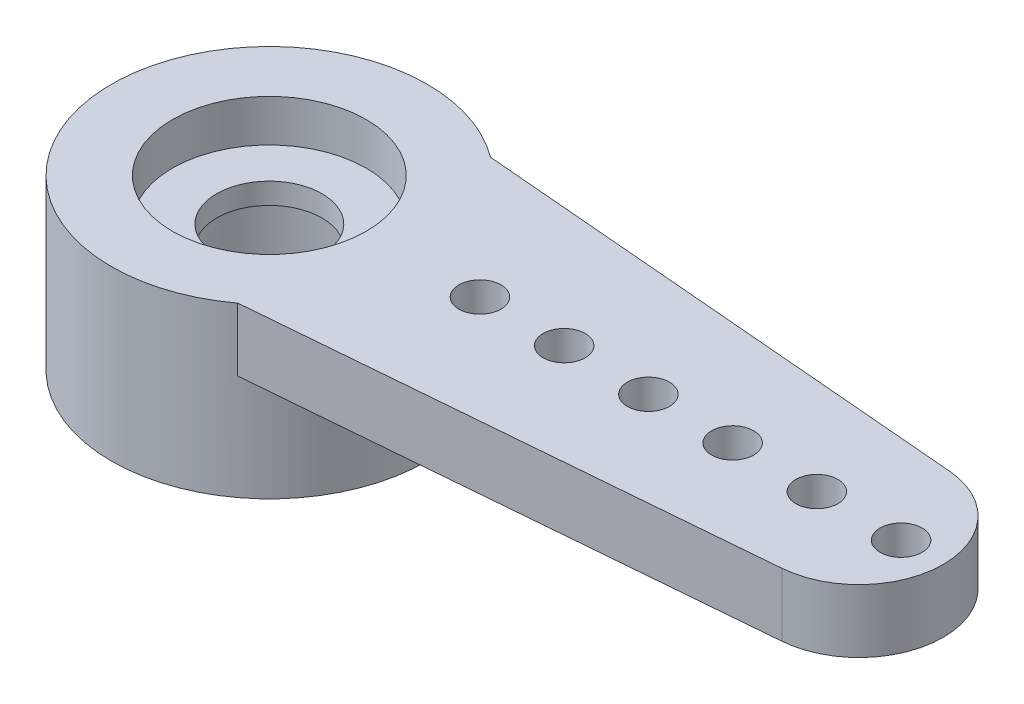
ISO-10303-21;
HEADER;
FILE_DESCRIPTION(('STEP AP214'),'2;1');
FILE_NAME('part.step','',(''),(''),'','','');
FILE_SCHEMA(('AUTOMOTIVE_DESIGN { 1 0 10303 214 1 1 1 1 }'));
ENDSEC;
DATA;
#1=APPLICATION_CONTEXT('core data for automotive mechanical design processes');
#2=APPLICATION_PROTOCOL_DEFINITION('international standard','automotive_design',2000,#1);
#3=PRODUCT_CONTEXT('',#1,'mechanical');
#4=PRODUCT('Part','Part','',(#3));
#5=PRODUCT_RELATED_PRODUCT_CATEGORY('part','',(#4));
#6=PRODUCT_DEFINITION_FORMATION('','',#4);
#7=PRODUCT_DEFINITION_CONTEXT('part definition',#1,'design');
#8=PRODUCT_DEFINITION('design','',#6,#7);
#9=PRODUCT_DEFINITION_SHAPE('','',#8);
#10=(LENGTH_UNIT() NAMED_UNIT(*) SI_UNIT(.MILLI.,.METRE.));
#11=(NAMED_UNIT(*) PLANE_ANGLE_UNIT() SI_UNIT($,.RADIAN.));
#12=(NAMED_UNIT(*) SI_UNIT($,.STERADIAN.) SOLID_ANGLE_UNIT());
#13=UNCERTAINTY_MEASURE_WITH_UNIT(LENGTH_MEASURE(1.E-05),#10,'distance_accuracy_value','');
#14=(GEOMETRIC_REPRESENTATION_CONTEXT(3) GLOBAL_UNCERTAINTY_ASSIGNED_CONTEXT((#13)) GLOBAL_UNIT_ASSIGNED_CONTEXT((#10,
#11,#12)) REPRESENTATION_CONTEXT('',''));
#15=CARTESIAN_POINT('',(0.,0.,0.));
#16=DIRECTION('',(0.,0.,1.));
#17=DIRECTION('',(1.,0.,0.));
#18=AXIS2_PLACEMENT_3D('',#15,#16,#17);
#19=CARTESIAN_POINT('',(0.,-1.5,0.));
#20=DIRECTION('',(0.,1.,0.));
#21=DIRECTION('',(0.,0.,1.));
#22=AXIS2_PLACEMENT_3D('',#19,#20,#21);
#23=CYLINDRICAL_SURFACE('',#22,1.25);
#24=CARTESIAN_POINT('',(0.,3.,0.));
#25=DIRECTION('',(0.,1.,0.));
#26=DIRECTION('',(0.,0.,1.));
#27=AXIS2_PLACEMENT_3D('',#24,#25,#26);
#28=CIRCLE('',#27,1.25);
#29=CARTESIAN_POINT('',(0.,3.,1.25));
#30=VERTEX_POINT('',#29);
#31=EDGE_CURVE('E190',#30,#30,#28,.T.);
#32=ORIENTED_EDGE('',*,*,#31,.T.);
#33=EDGE_LOOP('',(#32));
#34=FACE_BOUND('',#33,.T.);
#35=CARTESIAN_POINT('',(0.,2.5,0.));
#36=DIRECTION('',(0.,-1.,0.));
#37=DIRECTION('',(0.,0.,-1.));
#38=AXIS2_PLACEMENT_3D('',#35,#36,#37);
#39=CIRCLE('',#38,1.25);
#40=CARTESIAN_POINT('',(0.,2.5,-1.25));
#41=VERTEX_POINT('',#40);
#42=EDGE_CURVE('E38',#41,#41,#39,.F.);
#43=ORIENTED_EDGE('',*,*,#42,.F.);
#44=EDGE_LOOP('',(#43));
#45=FACE_BOUND('',#44,.T.);
#46=ADVANCED_FACE('F34',(#34,#45),#23,.F.);
#47=CARTESIAN_POINT('',(0.,4.,0.));
#48=DIRECTION('',(0.,-1.,0.));
#49=DIRECTION('',(0.,0.,-1.));
#50=AXIS2_PLACEMENT_3D('',#47,#48,#49);
#51=CYLINDRICAL_SURFACE('',#50,3.75);
#52=CARTESIAN_POINT('',(0.,4.,0.));
#53=DIRECTION('',(0.,1.,0.));
#54=DIRECTION('',(0.,0.,1.));
#55=AXIS2_PLACEMENT_3D('',#52,#53,#54);
#56=CIRCLE('',#55,3.75);
#57=CARTESIAN_POINT('',(2.25,4.,-3.));
#58=VERTEX_POINT('',#57);
#59=CARTESIAN_POINT('',(2.25,4.,3.));
#60=VERTEX_POINT('',#59);
#61=EDGE_CURVE('E11',#58,#60,#56,.T.);
#62=ORIENTED_EDGE('',*,*,#61,.F.);
#63=DIRECTION('',(0.,1.,0.));
#64=VECTOR('',#63,1.);
#65=CARTESIAN_POINT('',(2.25,2.5,-3.));
#66=LINE('',#65,#64);
#67=CARTESIAN_POINT('',(2.25,2.5,-3.));
#68=VERTEX_POINT('',#67);
#69=EDGE_CURVE('E107',#68,#58,#66,.T.);
#70=ORIENTED_EDGE('',*,*,#69,.F.);
#71=CARTESIAN_POINT('',(0.,2.5,0.));
#72=DIRECTION('',(0.,-1.,0.));
#73=DIRECTION('',(0.,0.,-1.));
#74=AXIS2_PLACEMENT_3D('',#71,#72,#73);
#75=CIRCLE('',#74,3.75);
#76=CARTESIAN_POINT('',(2.25,2.5,3.));
#77=VERTEX_POINT('',#76);
#78=EDGE_CURVE('E59',#68,#77,#75,.T.);
#79=ORIENTED_EDGE('',*,*,#78,.T.);
#80=DIRECTION('',(0.,1.,0.));
#81=VECTOR('',#80,1.);
#82=CARTESIAN_POINT('',(2.25,2.5,3.));
#83=LINE('',#82,#81);
#84=EDGE_CURVE('E83',#77,#60,#83,.T.);
#85=ORIENTED_EDGE('',*,*,#84,.T.);
#86=EDGE_LOOP('',(#62,#70,#79,#85));
#87=FACE_BOUND('',#86,.T.);
#88=CARTESIAN_POINT('',(0.,0.,0.));
#89=DIRECTION('',(0.,1.,0.));
#90=DIRECTION('',(0.,0.,1.));
#91=AXIS2_PLACEMENT_3D('',#88,#89,#90);
#92=CIRCLE('',#91,3.75);
#93=CARTESIAN_POINT('',(0.,0.,3.75));
#94=VERTEX_POINT('',#93);
#95=EDGE_CURVE('E43',#94,#94,#92,.T.);
#96=ORIENTED_EDGE('',*,*,#95,.T.);
#97=EDGE_LOOP('',(#96));
#98=FACE_BOUND('',#97,.T.);
#99=ADVANCED_FACE('F36',(#87,#98),#51,.T.);
#100=CARTESIAN_POINT('',(0.,4.,0.));
#101=DIRECTION('',(0.,1.,0.));
#102=DIRECTION('',(0.,0.,1.));
#103=AXIS2_PLACEMENT_3D('',#100,#101,#102);
#104=PLANE('',#103);
#105=CARTESIAN_POINT('',(0.,4.,0.));
#106=DIRECTION('',(0.,1.,0.));
#107=DIRECTION('',(0.,0.,1.));
#108=AXIS2_PLACEMENT_3D('',#105,#106,#107);
#109=CIRCLE('',#108,2.3);
#110=CARTESIAN_POINT('',(0.,4.,2.3));
#111=VERTEX_POINT('',#110);
#112=EDGE_CURVE('E109',#111,#111,#109,.T.);
#113=ORIENTED_EDGE('',*,*,#112,.F.);
#114=EDGE_LOOP('',(#113));
#115=FACE_BOUND('',#114,.T.);
#116=ORIENTED_EDGE('',*,*,#61,.T.);
#117=DIRECTION('',(0.996448898518601,0.,-0.0841997187707063));
#118=VECTOR('',#117,1.);
#119=CARTESIAN_POINT('',(14.1683994375414,4.,1.9928977970372));
#120=LINE('',#119,#118);
#121=CARTESIAN_POINT('',(14.1683994375414,4.,1.99289779703721));
#122=VERTEX_POINT('',#121);
#123=EDGE_CURVE('E102',#60,#122,#120,.T.);
#124=ORIENTED_EDGE('',*,*,#123,.T.);
#125=CARTESIAN_POINT('',(14.,4.,0.));
#126=DIRECTION('',(0.,1.,0.));
#127=DIRECTION('',(0.,0.,-1.));
#128=AXIS2_PLACEMENT_3D('',#125,#126,#127);
#129=CIRCLE('',#128,2.);
#130=CARTESIAN_POINT('',(14.1683994375414,4.,-1.9928977970372));
#131=VERTEX_POINT('',#130);
#132=EDGE_CURVE('E89',#122,#131,#129,.T.);
#133=ORIENTED_EDGE('',*,*,#132,.T.);
#134=DIRECTION('',(-0.996448898518601,0.,-0.0841997187707069));
#135=VECTOR('',#134,1.);
#136=CARTESIAN_POINT('',(14.1683994375414,4.,-1.9928977970372));
#137=LINE('',#136,#135);
#138=EDGE_CURVE('E50',#131,#58,#137,.T.);
#139=ORIENTED_EDGE('',*,*,#138,.T.);
#140=EDGE_LOOP('',(#116,#124,#133,#139));
#141=FACE_BOUND('',#140,.T.);
#142=CARTESIAN_POINT('',(13.,4.,0.));
#143=DIRECTION('',(0.,1.,0.));
#144=DIRECTION('',(0.,0.,-1.));
#145=AXIS2_PLACEMENT_3D('',#142,#143,#144);
#146=CIRCLE('',#145,0.500000000000001);
#147=CARTESIAN_POINT('',(13.,4.,-0.499999999999997));
#148=VERTEX_POINT('',#147);
#149=EDGE_CURVE('E199',#148,#148,#146,.T.);
#150=ORIENTED_EDGE('',*,*,#149,.F.);
#151=EDGE_LOOP('',(#150));
#152=FACE_BOUND('',#151,.T.);
#153=CARTESIAN_POINT('',(11.,4.,0.));
#154=DIRECTION('',(0.,1.,0.));
#155=DIRECTION('',(0.,0.,-1.));
#156=AXIS2_PLACEMENT_3D('',#153,#154,#155);
#157=CIRCLE('',#156,0.500000000000001);
#158=CARTESIAN_POINT('',(11.,4.,-0.499999999999997));
#159=VERTEX_POINT('',#158);
#160=EDGE_CURVE('E203',#159,#159,#157,.T.);
#161=ORIENTED_EDGE('',*,*,#160,.F.);
#162=EDGE_LOOP('',(#161));
#163=FACE_BOUND('',#162,.T.);
#164=CARTESIAN_POINT('',(9.,4.,0.));
#165=DIRECTION('',(0.,1.,0.));
#166=DIRECTION('',(0.,0.,-1.));
#167=AXIS2_PLACEMENT_3D('',#164,#165,#166);
#168=CIRCLE('',#167,0.500000000000001);
#169=CARTESIAN_POINT('',(9.,4.,-0.499999999999997));
#170=VERTEX_POINT('',#169);
#171=EDGE_CURVE('E207',#170,#170,#168,.T.);
#172=ORIENTED_EDGE('',*,*,#171,.F.);
#173=EDGE_LOOP('',(#172));
#174=FACE_BOUND('',#173,.T.);
#175=CARTESIAN_POINT('',(7.,4.,0.));
#176=DIRECTION('',(0.,1.,0.));
#177=DIRECTION('',(0.,0.,-1.));
#178=AXIS2_PLACEMENT_3D('',#175,#176,#177);
#179=CIRCLE('',#178,0.500000000000001);
#180=CARTESIAN_POINT('',(7.,4.,-0.499999999999997));
#181=VERTEX_POINT('',#180);
#182=EDGE_CURVE('E211',#181,#181,#179,.T.);
#183=ORIENTED_EDGE('',*,*,#182,.F.);
#184=EDGE_LOOP('',(#183));
#185=FACE_BOUND('',#184,.T.);
#186=CARTESIAN_POINT('',(5.,4.,0.));
#187=DIRECTION('',(0.,1.,0.));
#188=DIRECTION('',(0.,0.,-1.));
#189=AXIS2_PLACEMENT_3D('',#186,#187,#188);
#190=CIRCLE('',#189,0.500000000000001);
#191=CARTESIAN_POINT('',(5.,4.,-0.499999999999997));
#192=VERTEX_POINT('',#191);
#193=EDGE_CURVE('E215',#192,#192,#190,.T.);
#194=ORIENTED_EDGE('',*,*,#193,.F.);
#195=EDGE_LOOP('',(#194));
#196=FACE_BOUND('',#195,.T.);
#197=CARTESIAN_POINT('',(15.,4.,0.));
#198=DIRECTION('',(0.,1.,0.));
#199=DIRECTION('',(0.,0.,-1.));
#200=AXIS2_PLACEMENT_3D('',#197,#198,#199);
#201=CIRCLE('',#200,0.500000000000001);
#202=CARTESIAN_POINT('',(15.,4.,-0.499999999999997));
#203=VERTEX_POINT('',#202);
#204=EDGE_CURVE('E218',#203,#203,#201,.T.);
#205=ORIENTED_EDGE('',*,*,#204,.F.);
#206=EDGE_LOOP('',(#205));
#207=FACE_BOUND('',#206,.T.);
#208=ADVANCED_FACE('F123',(#115,#141,#152,#163,#174,#185,#196,#207),#104,.T.);
#209=CARTESIAN_POINT('',(0.,0.,0.));
#210=DIRECTION('',(0.,1.,0.));
#211=DIRECTION('',(0.,0.,1.));
#212=AXIS2_PLACEMENT_3D('',#209,#210,#211);
#213=PLANE('',#212);
#214=CARTESIAN_POINT('',(0.,0.,0.));
#215=DIRECTION('',(0.,-1.,0.));
#216=DIRECTION('',(0.,0.,-1.));
#217=AXIS2_PLACEMENT_3D('',#214,#215,#216);
#218=CIRCLE('',#217,2.3);
#219=CARTESIAN_POINT('',(0.,0.,-2.3));
#220=VERTEX_POINT('',#219);
#221=EDGE_CURVE('E244',#220,#220,#218,.T.);
#222=ORIENTED_EDGE('',*,*,#221,.F.);
#223=EDGE_LOOP('',(#222));
#224=FACE_BOUND('',#223,.T.);
#225=ORIENTED_EDGE('',*,*,#95,.F.);
#226=EDGE_LOOP('',(#225));
#227=FACE_BOUND('',#226,.T.);
#228=ADVANCED_FACE('F120',(#224,#227),#213,.F.);
#229=CARTESIAN_POINT('',(0.,3.,0.));
#230=DIRECTION('',(0.,1.,0.));
#231=DIRECTION('',(0.,0.,1.));
#232=AXIS2_PLACEMENT_3D('',#229,#230,#231);
#233=CYLINDRICAL_SURFACE('',#232,2.3);
#234=CARTESIAN_POINT('',(0.,3.,0.));
#235=DIRECTION('',(0.,1.,0.));
#236=DIRECTION('',(0.,0.,1.));
#237=AXIS2_PLACEMENT_3D('',#234,#235,#236);
#238=CIRCLE('',#237,2.3);
#239=CARTESIAN_POINT('',(0.,3.,2.3));
#240=VERTEX_POINT('',#239);
#241=EDGE_CURVE('E112',#240,#240,#238,.T.);
#242=ORIENTED_EDGE('',*,*,#241,.F.);
#243=EDGE_LOOP('',(#242));
#244=FACE_BOUND('',#243,.T.);
#245=ORIENTED_EDGE('',*,*,#112,.T.);
#246=EDGE_LOOP('',(#245));
#247=FACE_BOUND('',#246,.T.);
#248=ADVANCED_FACE('F122',(#244,#247),#233,.F.);
#249=CARTESIAN_POINT('',(0.,3.,0.));
#250=DIRECTION('',(0.,1.,0.));
#251=DIRECTION('',(0.,0.,1.));
#252=AXIS2_PLACEMENT_3D('',#249,#250,#251);
#253=PLANE('',#252);
#254=ORIENTED_EDGE('',*,*,#31,.F.);
#255=EDGE_LOOP('',(#254));
#256=FACE_BOUND('',#255,.T.);
#257=ORIENTED_EDGE('',*,*,#241,.T.);
#258=EDGE_LOOP('',(#257));
#259=FACE_BOUND('',#258,.T.);
#260=ADVANCED_FACE('F129',(#256,#259),#253,.T.);
#261=CARTESIAN_POINT('',(14.1683994375414,2.5,-1.9928977970372));
#262=DIRECTION('',(0.0841997187707069,0.,-0.996448898518601));
#263=DIRECTION('',(-0.996448898518601,0.,-0.0841997187707069));
#264=AXIS2_PLACEMENT_3D('',#261,#262,#263);
#265=PLANE('',#264);
#266=ORIENTED_EDGE('',*,*,#138,.F.);
#267=DIRECTION('',(0.,1.,0.));
#268=VECTOR('',#267,1.);
#269=CARTESIAN_POINT('',(14.1683994375414,2.5,-1.9928977970372));
#270=LINE('',#269,#268);
#271=CARTESIAN_POINT('',(14.1683994375414,2.5,-1.9928977970372));
#272=VERTEX_POINT('',#271);
#273=EDGE_CURVE('E77',#272,#131,#270,.T.);
#274=ORIENTED_EDGE('',*,*,#273,.F.);
#275=DIRECTION('',(-0.996448898518601,0.,-0.0841997187707069));
#276=VECTOR('',#275,1.);
#277=CARTESIAN_POINT('',(14.1683994375414,2.5,-1.9928977970372));
#278=LINE('',#277,#276);
#279=EDGE_CURVE('E94',#272,#68,#278,.T.);
#280=ORIENTED_EDGE('',*,*,#279,.T.);
#281=ORIENTED_EDGE('',*,*,#69,.T.);
#282=EDGE_LOOP('',(#266,#274,#280,#281));
#283=FACE_BOUND('',#282,.T.);
#284=ADVANCED_FACE('F176',(#283),#265,.T.);
#285=CARTESIAN_POINT('',(14.,2.5,0.));
#286=DIRECTION('',(0.,1.,0.));
#287=DIRECTION('',(0.,0.,1.));
#288=AXIS2_PLACEMENT_3D('',#285,#286,#287);
#289=CYLINDRICAL_SURFACE('',#288,2.);
#290=ORIENTED_EDGE('',*,*,#132,.F.);
#291=DIRECTION('',(0.,1.,0.));
#292=VECTOR('',#291,1.);
#293=CARTESIAN_POINT('',(14.1683994375414,2.5,1.99289779703721));
#294=LINE('',#293,#292);
#295=CARTESIAN_POINT('',(14.1683994375414,2.5,1.99289779703721));
#296=VERTEX_POINT('',#295);
#297=EDGE_CURVE('E85',#296,#122,#294,.T.);
#298=ORIENTED_EDGE('',*,*,#297,.F.);
#299=CARTESIAN_POINT('',(14.,2.5,0.));
#300=DIRECTION('',(0.,1.,0.));
#301=DIRECTION('',(0.,0.,-1.));
#302=AXIS2_PLACEMENT_3D('',#299,#300,#301);
#303=CIRCLE('',#302,2.);
#304=EDGE_CURVE('E88',#296,#272,#303,.T.);
#305=ORIENTED_EDGE('',*,*,#304,.T.);
#306=ORIENTED_EDGE('',*,*,#273,.T.);
#307=EDGE_LOOP('',(#290,#298,#305,#306));
#308=FACE_BOUND('',#307,.T.);
#309=ADVANCED_FACE('F87',(#308),#289,.T.);
#310=CARTESIAN_POINT('',(14.1683994375414,2.5,1.9928977970372));
#311=DIRECTION('',(0.0841997187707063,0.,0.996448898518601));
#312=DIRECTION('',(0.996448898518601,0.,-0.0841997187707063));
#313=AXIS2_PLACEMENT_3D('',#310,#311,#312);
#314=PLANE('',#313);
#315=ORIENTED_EDGE('',*,*,#123,.F.);
#316=ORIENTED_EDGE('',*,*,#84,.F.);
#317=DIRECTION('',(0.996448898518601,0.,-0.0841997187707063));
#318=VECTOR('',#317,1.);
#319=CARTESIAN_POINT('',(14.1683994375414,2.5,1.9928977970372));
#320=LINE('',#319,#318);
#321=EDGE_CURVE('E93',#77,#296,#320,.T.);
#322=ORIENTED_EDGE('',*,*,#321,.T.);
#323=ORIENTED_EDGE('',*,*,#297,.T.);
#324=EDGE_LOOP('',(#315,#316,#322,#323));
#325=FACE_BOUND('',#324,.T.);
#326=ADVANCED_FACE('F96',(#325),#314,.T.);
#327=CARTESIAN_POINT('',(0.,2.5,0.));
#328=DIRECTION('',(0.,-1.,0.));
#329=DIRECTION('',(0.,0.,-1.));
#330=AXIS2_PLACEMENT_3D('',#327,#328,#329);
#331=PLANE('',#330);
#332=CARTESIAN_POINT('',(13.,2.5,0.));
#333=DIRECTION('',(0.,1.,0.));
#334=DIRECTION('',(0.,0.,-1.));
#335=AXIS2_PLACEMENT_3D('',#332,#333,#334);
#336=CIRCLE('',#335,0.500000000000001);
#337=CARTESIAN_POINT('',(13.,2.5,-0.499999999999997));
#338=VERTEX_POINT('',#337);
#339=EDGE_CURVE('E237',#338,#338,#336,.T.);
#340=ORIENTED_EDGE('',*,*,#339,.T.);
#341=EDGE_LOOP('',(#340));
#342=FACE_BOUND('',#341,.T.);
#343=CARTESIAN_POINT('',(11.,2.5,0.));
#344=DIRECTION('',(0.,1.,0.));
#345=DIRECTION('',(0.,0.,-1.));
#346=AXIS2_PLACEMENT_3D('',#343,#344,#345);
#347=CIRCLE('',#346,0.500000000000001);
#348=CARTESIAN_POINT('',(11.,2.5,-0.499999999999997));
#349=VERTEX_POINT('',#348);
#350=EDGE_CURVE('E233',#349,#349,#347,.T.);
#351=ORIENTED_EDGE('',*,*,#350,.T.);
#352=EDGE_LOOP('',(#351));
#353=FACE_BOUND('',#352,.T.);
#354=CARTESIAN_POINT('',(9.,2.5,0.));
#355=DIRECTION('',(0.,1.,0.));
#356=DIRECTION('',(0.,0.,-1.));
#357=AXIS2_PLACEMENT_3D('',#354,#355,#356);
#358=CIRCLE('',#357,0.500000000000001);
#359=CARTESIAN_POINT('',(9.,2.5,-0.499999999999997));
#360=VERTEX_POINT('',#359);
#361=EDGE_CURVE('E229',#360,#360,#358,.T.);
#362=ORIENTED_EDGE('',*,*,#361,.T.);
#363=EDGE_LOOP('',(#362));
#364=FACE_BOUND('',#363,.T.);
#365=CARTESIAN_POINT('',(7.,2.5,0.));
#366=DIRECTION('',(0.,1.,0.));
#367=DIRECTION('',(0.,0.,-1.));
#368=AXIS2_PLACEMENT_3D('',#365,#366,#367);
#369=CIRCLE('',#368,0.500000000000001);
#370=CARTESIAN_POINT('',(7.,2.5,-0.499999999999997));
#371=VERTEX_POINT('',#370);
#372=EDGE_CURVE('E226',#371,#371,#369,.T.);
#373=ORIENTED_EDGE('',*,*,#372,.T.);
#374=EDGE_LOOP('',(#373));
#375=FACE_BOUND('',#374,.T.);
#376=CARTESIAN_POINT('',(5.,2.5,0.));
#377=DIRECTION('',(0.,1.,0.));
#378=DIRECTION('',(0.,0.,-1.));
#379=AXIS2_PLACEMENT_3D('',#376,#377,#378);
#380=CIRCLE('',#379,0.500000000000001);
#381=CARTESIAN_POINT('',(5.,2.5,-0.499999999999997));
#382=VERTEX_POINT('',#381);
#383=EDGE_CURVE('E220',#382,#382,#380,.T.);
#384=ORIENTED_EDGE('',*,*,#383,.T.);
#385=EDGE_LOOP('',(#384));
#386=FACE_BOUND('',#385,.T.);
#387=CARTESIAN_POINT('',(15.,2.5,0.));
#388=DIRECTION('',(0.,1.,0.));
#389=DIRECTION('',(0.,0.,-1.));
#390=AXIS2_PLACEMENT_3D('',#387,#388,#389);
#391=CIRCLE('',#390,0.500000000000001);
#392=CARTESIAN_POINT('',(15.,2.5,-0.499999999999997));
#393=VERTEX_POINT('',#392);
#394=EDGE_CURVE('E104',#393,#393,#391,.T.);
#395=ORIENTED_EDGE('',*,*,#394,.T.);
#396=EDGE_LOOP('',(#395));
#397=FACE_BOUND('',#396,.T.);
#398=ORIENTED_EDGE('',*,*,#78,.F.);
#399=ORIENTED_EDGE('',*,*,#279,.F.);
#400=ORIENTED_EDGE('',*,*,#304,.F.);
#401=ORIENTED_EDGE('',*,*,#321,.F.);
#402=EDGE_LOOP('',(#398,#399,#400,#401));
#403=FACE_BOUND('',#402,.T.);
#404=ADVANCED_FACE('F92',(#342,#353,#364,#375,#386,#397,#403),#331,.T.);
#405=CARTESIAN_POINT('',(15.,2.5,0.));
#406=DIRECTION('',(0.,1.,0.));
#407=DIRECTION('',(0.,0.,1.));
#408=AXIS2_PLACEMENT_3D('',#405,#406,#407);
#409=CYLINDRICAL_SURFACE('',#408,0.500000000000001);
#410=ORIENTED_EDGE('',*,*,#394,.F.);
#411=EDGE_LOOP('',(#410));
#412=FACE_BOUND('',#411,.T.);
#413=ORIENTED_EDGE('',*,*,#204,.T.);
#414=EDGE_LOOP('',(#413));
#415=FACE_BOUND('',#414,.T.);
#416=ADVANCED_FACE('F168',(#412,#415),#409,.F.);
#417=CARTESIAN_POINT('',(5.,2.5,0.));
#418=DIRECTION('',(0.,1.,0.));
#419=DIRECTION('',(0.,0.,1.));
#420=AXIS2_PLACEMENT_3D('',#417,#418,#419);
#421=CYLINDRICAL_SURFACE('',#420,0.500000000000001);
#422=ORIENTED_EDGE('',*,*,#383,.F.);
#423=EDGE_LOOP('',(#422));
#424=FACE_BOUND('',#423,.T.);
#425=ORIENTED_EDGE('',*,*,#193,.T.);
#426=EDGE_LOOP('',(#425));
#427=FACE_BOUND('',#426,.T.);
#428=ADVANCED_FACE('F164',(#424,#427),#421,.F.);
#429=CARTESIAN_POINT('',(7.,2.5,0.));
#430=DIRECTION('',(0.,1.,0.));
#431=DIRECTION('',(0.,0.,1.));
#432=AXIS2_PLACEMENT_3D('',#429,#430,#431);
#433=CYLINDRICAL_SURFACE('',#432,0.500000000000001);
#434=ORIENTED_EDGE('',*,*,#372,.F.);
#435=EDGE_LOOP('',(#434));
#436=FACE_BOUND('',#435,.T.);
#437=ORIENTED_EDGE('',*,*,#182,.T.);
#438=EDGE_LOOP('',(#437));
#439=FACE_BOUND('',#438,.T.);
#440=ADVANCED_FACE('F160',(#436,#439),#433,.F.);
#441=CARTESIAN_POINT('',(9.,2.5,0.));
#442=DIRECTION('',(0.,1.,0.));
#443=DIRECTION('',(0.,0.,1.));
#444=AXIS2_PLACEMENT_3D('',#441,#442,#443);
#445=CYLINDRICAL_SURFACE('',#444,0.500000000000001);
#446=ORIENTED_EDGE('',*,*,#361,.F.);
#447=EDGE_LOOP('',(#446));
#448=FACE_BOUND('',#447,.T.);
#449=ORIENTED_EDGE('',*,*,#171,.T.);
#450=EDGE_LOOP('',(#449));
#451=FACE_BOUND('',#450,.T.);
#452=ADVANCED_FACE('F156',(#448,#451),#445,.F.);
#453=CARTESIAN_POINT('',(11.,2.5,0.));
#454=DIRECTION('',(0.,1.,0.));
#455=DIRECTION('',(0.,0.,1.));
#456=AXIS2_PLACEMENT_3D('',#453,#454,#455);
#457=CYLINDRICAL_SURFACE('',#456,0.500000000000001);
#458=ORIENTED_EDGE('',*,*,#350,.F.);
#459=EDGE_LOOP('',(#458));
#460=FACE_BOUND('',#459,.T.);
#461=ORIENTED_EDGE('',*,*,#160,.T.);
#462=EDGE_LOOP('',(#461));
#463=FACE_BOUND('',#462,.T.);
#464=ADVANCED_FACE('F152',(#460,#463),#457,.F.);
#465=CARTESIAN_POINT('',(13.,2.5,0.));
#466=DIRECTION('',(0.,1.,0.));
#467=DIRECTION('',(0.,0.,1.));
#468=AXIS2_PLACEMENT_3D('',#465,#466,#467);
#469=CYLINDRICAL_SURFACE('',#468,0.500000000000001);
#470=ORIENTED_EDGE('',*,*,#339,.F.);
#471=EDGE_LOOP('',(#470));
#472=FACE_BOUND('',#471,.T.);
#473=ORIENTED_EDGE('',*,*,#149,.T.);
#474=EDGE_LOOP('',(#473));
#475=FACE_BOUND('',#474,.T.);
#476=ADVANCED_FACE('F148',(#472,#475),#469,.F.);
#477=CARTESIAN_POINT('',(0.,2.5,0.));
#478=DIRECTION('',(0.,-1.,0.));
#479=DIRECTION('',(0.,0.,-1.));
#480=AXIS2_PLACEMENT_3D('',#477,#478,#479);
#481=PLANE('',#480);
#482=CARTESIAN_POINT('',(0.,2.5,0.));
#483=DIRECTION('',(0.,-1.,0.));
#484=DIRECTION('',(0.,0.,-1.));
#485=AXIS2_PLACEMENT_3D('',#482,#483,#484);
#486=CIRCLE('',#485,2.3);
#487=CARTESIAN_POINT('',(0.,2.5,-2.3));
#488=VERTEX_POINT('',#487);
#489=EDGE_CURVE('E247',#488,#488,#486,.T.);
#490=ORIENTED_EDGE('',*,*,#489,.T.);
#491=EDGE_LOOP('',(#490));
#492=FACE_BOUND('',#491,.T.);
#493=ORIENTED_EDGE('',*,*,#42,.T.);
#494=EDGE_LOOP('',(#493));
#495=FACE_BOUND('',#494,.T.);
#496=ADVANCED_FACE('F151',(#492,#495),#481,.T.);
#497=CARTESIAN_POINT('',(0.,2.5,0.));
#498=DIRECTION('',(0.,-1.,0.));
#499=DIRECTION('',(0.,0.,-1.));
#500=AXIS2_PLACEMENT_3D('',#497,#498,#499);
#501=CYLINDRICAL_SURFACE('',#500,2.3);
#502=ORIENTED_EDGE('',*,*,#489,.F.);
#503=EDGE_LOOP('',(#502));
#504=FACE_BOUND('',#503,.T.);
#505=ORIENTED_EDGE('',*,*,#221,.T.);
#506=EDGE_LOOP('',(#505));
#507=FACE_BOUND('',#506,.T.);
#508=ADVANCED_FACE('F146',(#504,#507),#501,.F.);
#509=CLOSED_SHELL('',(#46,#99,#208,#228,#248,#260,#284,#309,#326,#404,#416,#428,#440,#452,#464,
#476,#496,#508));
#510=MANIFOLD_SOLID_BREP('B2',#509);
#511=ADVANCED_BREP_SHAPE_REPRESENTATION('',(#18,#510),#14);
#512=SHAPE_DEFINITION_REPRESENTATION(#9,#511);
ENDSEC;
END-ISO-10303-21;
